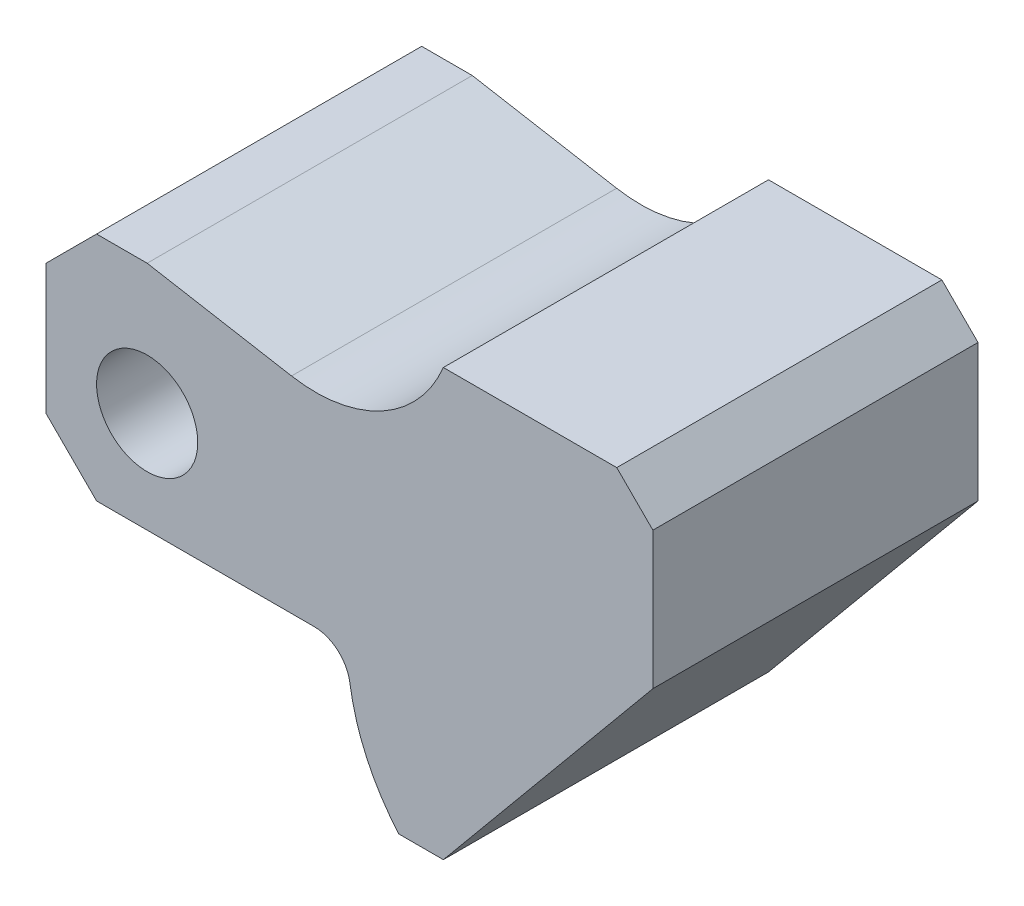
ISO-10303-21;
HEADER;
FILE_DESCRIPTION(('STEP AP214'),'2;1');
FILE_NAME('part.step','',(''),(''),'','','');
FILE_SCHEMA(('AUTOMOTIVE_DESIGN { 1 0 10303 214 1 1 1 1 }'));
ENDSEC;
DATA;
#1=APPLICATION_CONTEXT('core data for automotive mechanical design processes');
#2=APPLICATION_PROTOCOL_DEFINITION('international standard','automotive_design',2000,#1);
#3=PRODUCT_CONTEXT('',#1,'mechanical');
#4=PRODUCT('Part','Part','',(#3));
#5=PRODUCT_RELATED_PRODUCT_CATEGORY('part','',(#4));
#6=PRODUCT_DEFINITION_FORMATION('','',#4);
#7=PRODUCT_DEFINITION_CONTEXT('part definition',#1,'design');
#8=PRODUCT_DEFINITION('design','',#6,#7);
#9=PRODUCT_DEFINITION_SHAPE('','',#8);
#10=(LENGTH_UNIT() NAMED_UNIT(*) SI_UNIT(.MILLI.,.METRE.));
#11=(NAMED_UNIT(*) PLANE_ANGLE_UNIT() SI_UNIT($,.RADIAN.));
#12=(NAMED_UNIT(*) SI_UNIT($,.STERADIAN.) SOLID_ANGLE_UNIT());
#13=UNCERTAINTY_MEASURE_WITH_UNIT(LENGTH_MEASURE(1.E-05),#10,'distance_accuracy_value','');
#14=(GEOMETRIC_REPRESENTATION_CONTEXT(3) GLOBAL_UNCERTAINTY_ASSIGNED_CONTEXT((#13)) GLOBAL_UNIT_ASSIGNED_CONTEXT((#10,
#11,#12)) REPRESENTATION_CONTEXT('',''));
#15=CARTESIAN_POINT('',(0.,0.,0.));
#16=DIRECTION('',(0.,0.,1.));
#17=DIRECTION('',(1.,0.,0.));
#18=AXIS2_PLACEMENT_3D('',#15,#16,#17);
#19=CARTESIAN_POINT('',(70.7428571428571,0.,22.5));
#20=DIRECTION('',(0.,0.,1.));
#21=DIRECTION('',(1.,0.,0.));
#22=AXIS2_PLACEMENT_3D('',#19,#20,#21);
#23=PLANE('',#22);
#24=CARTESIAN_POINT('',(70.7428571428571,0.,22.5));
#25=DIRECTION('',(0.,0.,1.));
#26=DIRECTION('',(1.,0.,0.));
#27=AXIS2_PLACEMENT_3D('',#24,#25,#26);
#28=CIRCLE('',#27,29.);
#29=CARTESIAN_POINT('',(42.0581524426685,-4.26470588235294,22.5));
#30=VERTEX_POINT('',#29);
#31=CARTESIAN_POINT('',(48.8339548426505,-19.,22.5));
#32=VERTEX_POINT('',#31);
#33=EDGE_CURVE('E207',#30,#32,#28,.T.);
#34=ORIENTED_EDGE('',*,*,#33,.T.);
#35=DIRECTION('',(1.,0.,0.));
#36=VECTOR('',#35,1.);
#37=CARTESIAN_POINT('',(48.8339548426505,-19.,22.5));
#38=LINE('',#37,#36);
#39=CARTESIAN_POINT('',(55.,-19.,22.5));
#40=VERTEX_POINT('',#39);
#41=EDGE_CURVE('E125',#32,#40,#38,.T.);
#42=ORIENTED_EDGE('',*,*,#41,.T.);
#43=DIRECTION('',(0.638017864750323,0.770021560905562,0.));
#44=VECTOR('',#43,1.);
#45=CARTESIAN_POINT('',(55.,-19.,22.5));
#46=LINE('',#45,#44);
#47=CARTESIAN_POINT('',(84.,16.,22.5));
#48=VERTEX_POINT('',#47);
#49=EDGE_CURVE('E240',#40,#48,#46,.T.);
#50=ORIENTED_EDGE('',*,*,#49,.T.);
#51=DIRECTION('',(0.,1.,0.));
#52=VECTOR('',#51,1.);
#53=CARTESIAN_POINT('',(84.,16.,22.5));
#54=LINE('',#53,#52);
#55=CARTESIAN_POINT('',(84.,35.,22.5));
#56=VERTEX_POINT('',#55);
#57=EDGE_CURVE('E259',#48,#56,#54,.T.);
#58=ORIENTED_EDGE('',*,*,#57,.T.);
#59=DIRECTION('',(-0.707106781186546,0.707106781186549,0.));
#60=VECTOR('',#59,1.);
#61=CARTESIAN_POINT('',(84.,35.,22.5));
#62=LINE('',#61,#60);
#63=CARTESIAN_POINT('',(79.,40.,22.5));
#64=VERTEX_POINT('',#63);
#65=EDGE_CURVE('E256',#56,#64,#62,.T.);
#66=ORIENTED_EDGE('',*,*,#65,.T.);
#67=DIRECTION('',(-1.,0.,0.));
#68=VECTOR('',#67,1.);
#69=CARTESIAN_POINT('',(79.,40.,22.5));
#70=LINE('',#69,#68);
#71=CARTESIAN_POINT('',(55.,40.,22.5));
#72=VERTEX_POINT('',#71);
#73=EDGE_CURVE('E258',#64,#72,#70,.T.);
#74=ORIENTED_EDGE('',*,*,#73,.T.);
#75=CARTESIAN_POINT('',(37.3103485828417,47.3354399295799,22.5));
#76=DIRECTION('',(0.,0.,-1.));
#77=DIRECTION('',(-1.,0.,0.));
#78=AXIS2_PLACEMENT_3D('',#75,#76,#77);
#79=CIRCLE('',#78,19.1502596906947);
#80=CARTESIAN_POINT('',(33.9849408857041,28.4761157139866,22.5));
#81=VERTEX_POINT('',#80);
#82=EDGE_CURVE('E261',#72,#81,#79,.T.);
#83=ORIENTED_EDGE('',*,*,#82,.T.);
#84=DIRECTION('',(-0.984807753012208,0.173648177666931,0.));
#85=VECTOR('',#84,1.);
#86=CARTESIAN_POINT('',(33.9849408857041,28.4761157139866,22.5));
#87=LINE('',#86,#85);
#88=CARTESIAN_POINT('',(14.,32.,22.5));
#89=VERTEX_POINT('',#88);
#90=EDGE_CURVE('E267',#81,#89,#87,.T.);
#91=ORIENTED_EDGE('',*,*,#90,.T.);
#92=DIRECTION('',(-1.,0.,0.));
#93=VECTOR('',#92,1.);
#94=CARTESIAN_POINT('',(14.,32.,22.5));
#95=LINE('',#94,#93);
#96=CARTESIAN_POINT('',(7.,32.,22.5));
#97=VERTEX_POINT('',#96);
#98=EDGE_CURVE('E269',#89,#97,#95,.T.);
#99=ORIENTED_EDGE('',*,*,#98,.T.);
#100=DIRECTION('',(-0.707106781186548,-0.707106781186546,0.));
#101=VECTOR('',#100,1.);
#102=CARTESIAN_POINT('',(7.,32.,22.5));
#103=LINE('',#102,#101);
#104=CARTESIAN_POINT('',(0.,25.,22.5));
#105=VERTEX_POINT('',#104);
#106=EDGE_CURVE('E271',#97,#105,#103,.T.);
#107=ORIENTED_EDGE('',*,*,#106,.T.);
#108=DIRECTION('',(0.,-1.,0.));
#109=VECTOR('',#108,1.);
#110=CARTESIAN_POINT('',(0.,25.,22.5));
#111=LINE('',#110,#109);
#112=CARTESIAN_POINT('',(0.,7.,22.5));
#113=VERTEX_POINT('',#112);
#114=EDGE_CURVE('E162',#105,#113,#111,.T.);
#115=ORIENTED_EDGE('',*,*,#114,.T.);
#116=DIRECTION('',(0.707106781186547,-0.707106781186548,0.));
#117=VECTOR('',#116,1.);
#118=CARTESIAN_POINT('',(0.,7.,22.5));
#119=LINE('',#118,#117);
#120=CARTESIAN_POINT('',(6.99999999999998,0.,22.5));
#121=VERTEX_POINT('',#120);
#122=EDGE_CURVE('E156',#113,#121,#119,.T.);
#123=ORIENTED_EDGE('',*,*,#122,.T.);
#124=DIRECTION('',(1.,0.,0.));
#125=VECTOR('',#124,1.);
#126=CARTESIAN_POINT('',(6.99999999999998,0.,22.5));
#127=LINE('',#126,#125);
#128=CARTESIAN_POINT('',(37.1125137012567,0.,22.5));
#129=VERTEX_POINT('',#128);
#130=EDGE_CURVE('E160',#121,#129,#127,.T.);
#131=ORIENTED_EDGE('',*,*,#130,.T.);
#132=CARTESIAN_POINT('',(37.1125137012567,-5.,22.5));
#133=DIRECTION('',(0.,0.,-1.));
#134=DIRECTION('',(-1.,0.,0.));
#135=AXIS2_PLACEMENT_3D('',#132,#133,#134);
#136=CIRCLE('',#135,5.);
#137=EDGE_CURVE('E64',#129,#30,#136,.T.);
#138=ORIENTED_EDGE('',*,*,#137,.T.);
#139=EDGE_LOOP('',(#34,#42,#50,#58,#66,#74,#83,#91,#99,#107,#115,#123,#131,#138));
#140=FACE_BOUND('',#139,.T.);
#141=CARTESIAN_POINT('',(14.,14.,22.5));
#142=DIRECTION('',(0.,0.,1.));
#143=DIRECTION('',(1.,0.,0.));
#144=AXIS2_PLACEMENT_3D('',#141,#142,#143);
#145=CIRCLE('',#144,7.);
#146=CARTESIAN_POINT('',(21.,14.,22.5));
#147=VERTEX_POINT('',#146);
#148=EDGE_CURVE('E184',#147,#147,#145,.T.);
#149=ORIENTED_EDGE('',*,*,#148,.F.);
#150=EDGE_LOOP('',(#149));
#151=FACE_BOUND('',#150,.T.);
#152=ADVANCED_FACE('F47',(#140,#151),#23,.T.);
#153=CARTESIAN_POINT('',(70.7428571428571,0.,-22.5));
#154=DIRECTION('',(0.,0.,1.));
#155=DIRECTION('',(1.,0.,0.));
#156=AXIS2_PLACEMENT_3D('',#153,#154,#155);
#157=PLANE('',#156);
#158=CARTESIAN_POINT('',(70.7428571428571,0.,-22.5));
#159=DIRECTION('',(0.,0.,1.));
#160=DIRECTION('',(1.,0.,0.));
#161=AXIS2_PLACEMENT_3D('',#158,#159,#160);
#162=CIRCLE('',#161,29.);
#163=CARTESIAN_POINT('',(42.0581524426685,-4.26470588235294,-22.5));
#164=VERTEX_POINT('',#163);
#165=CARTESIAN_POINT('',(48.8339548426505,-19.,-22.5));
#166=VERTEX_POINT('',#165);
#167=EDGE_CURVE('E180',#164,#166,#162,.T.);
#168=ORIENTED_EDGE('',*,*,#167,.F.);
#169=CARTESIAN_POINT('',(37.1125137012567,-5.,-22.5));
#170=DIRECTION('',(0.,0.,-1.));
#171=DIRECTION('',(-1.,0.,0.));
#172=AXIS2_PLACEMENT_3D('',#169,#170,#171);
#173=CIRCLE('',#172,5.);
#174=CARTESIAN_POINT('',(37.1125137012567,0.,-22.5));
#175=VERTEX_POINT('',#174);
#176=EDGE_CURVE('E117',#175,#164,#173,.T.);
#177=ORIENTED_EDGE('',*,*,#176,.F.);
#178=DIRECTION('',(1.,0.,0.));
#179=VECTOR('',#178,1.);
#180=CARTESIAN_POINT('',(6.99999999999998,0.,-22.5));
#181=LINE('',#180,#179);
#182=CARTESIAN_POINT('',(6.99999999999998,0.,-22.5));
#183=VERTEX_POINT('',#182);
#184=EDGE_CURVE('E111',#183,#175,#181,.T.);
#185=ORIENTED_EDGE('',*,*,#184,.F.);
#186=DIRECTION('',(0.707106781186547,-0.707106781186548,0.));
#187=VECTOR('',#186,1.);
#188=CARTESIAN_POINT('',(0.,7.,-22.5));
#189=LINE('',#188,#187);
#190=CARTESIAN_POINT('',(0.,7.,-22.5));
#191=VERTEX_POINT('',#190);
#192=EDGE_CURVE('E170',#191,#183,#189,.T.);
#193=ORIENTED_EDGE('',*,*,#192,.F.);
#194=DIRECTION('',(0.,-1.,0.));
#195=VECTOR('',#194,1.);
#196=CARTESIAN_POINT('',(0.,25.,-22.5));
#197=LINE('',#196,#195);
#198=CARTESIAN_POINT('',(0.,25.,-22.5));
#199=VERTEX_POINT('',#198);
#200=EDGE_CURVE('E202',#199,#191,#197,.T.);
#201=ORIENTED_EDGE('',*,*,#200,.F.);
#202=DIRECTION('',(-0.707106781186548,-0.707106781186546,0.));
#203=VECTOR('',#202,1.);
#204=CARTESIAN_POINT('',(7.,32.,-22.5));
#205=LINE('',#204,#203);
#206=CARTESIAN_POINT('',(7.,32.,-22.5));
#207=VERTEX_POINT('',#206);
#208=EDGE_CURVE('E200',#207,#199,#205,.T.);
#209=ORIENTED_EDGE('',*,*,#208,.F.);
#210=DIRECTION('',(-1.,0.,0.));
#211=VECTOR('',#210,1.);
#212=CARTESIAN_POINT('',(14.,32.,-22.5));
#213=LINE('',#212,#211);
#214=CARTESIAN_POINT('',(14.,32.,-22.5));
#215=VERTEX_POINT('',#214);
#216=EDGE_CURVE('E198',#215,#207,#213,.T.);
#217=ORIENTED_EDGE('',*,*,#216,.F.);
#218=DIRECTION('',(-0.984807753012208,0.173648177666931,0.));
#219=VECTOR('',#218,1.);
#220=CARTESIAN_POINT('',(33.9849408857041,28.4761157139866,-22.5));
#221=LINE('',#220,#219);
#222=CARTESIAN_POINT('',(33.9849408857041,28.4761157139866,-22.5));
#223=VERTEX_POINT('',#222);
#224=EDGE_CURVE('E196',#223,#215,#221,.T.);
#225=ORIENTED_EDGE('',*,*,#224,.F.);
#226=CARTESIAN_POINT('',(37.3103485828417,47.3354399295799,-22.5));
#227=DIRECTION('',(0.,0.,-1.));
#228=DIRECTION('',(-1.,0.,0.));
#229=AXIS2_PLACEMENT_3D('',#226,#227,#228);
#230=CIRCLE('',#229,19.1502596906947);
#231=CARTESIAN_POINT('',(55.,40.,-22.5));
#232=VERTEX_POINT('',#231);
#233=EDGE_CURVE('E194',#232,#223,#230,.T.);
#234=ORIENTED_EDGE('',*,*,#233,.F.);
#235=DIRECTION('',(-1.,0.,0.));
#236=VECTOR('',#235,1.);
#237=CARTESIAN_POINT('',(79.,40.,-22.5));
#238=LINE('',#237,#236);
#239=CARTESIAN_POINT('',(79.,40.,-22.5));
#240=VERTEX_POINT('',#239);
#241=EDGE_CURVE('E192',#240,#232,#238,.T.);
#242=ORIENTED_EDGE('',*,*,#241,.F.);
#243=DIRECTION('',(-0.707106781186546,0.707106781186549,0.));
#244=VECTOR('',#243,1.);
#245=CARTESIAN_POINT('',(84.,35.,-22.5));
#246=LINE('',#245,#244);
#247=CARTESIAN_POINT('',(84.,35.,-22.5));
#248=VERTEX_POINT('',#247);
#249=EDGE_CURVE('E190',#248,#240,#246,.T.);
#250=ORIENTED_EDGE('',*,*,#249,.F.);
#251=DIRECTION('',(0.,1.,0.));
#252=VECTOR('',#251,1.);
#253=CARTESIAN_POINT('',(84.,16.,-22.5));
#254=LINE('',#253,#252);
#255=CARTESIAN_POINT('',(84.,16.,-22.5));
#256=VERTEX_POINT('',#255);
#257=EDGE_CURVE('E188',#256,#248,#254,.T.);
#258=ORIENTED_EDGE('',*,*,#257,.F.);
#259=DIRECTION('',(0.638017864750323,0.770021560905562,0.));
#260=VECTOR('',#259,1.);
#261=CARTESIAN_POINT('',(55.,-19.,-22.5));
#262=LINE('',#261,#260);
#263=CARTESIAN_POINT('',(55.,-19.,-22.5));
#264=VERTEX_POINT('',#263);
#265=EDGE_CURVE('E186',#264,#256,#262,.T.);
#266=ORIENTED_EDGE('',*,*,#265,.F.);
#267=DIRECTION('',(1.,0.,0.));
#268=VECTOR('',#267,1.);
#269=CARTESIAN_POINT('',(48.8339548426505,-19.,-22.5));
#270=LINE('',#269,#268);
#271=EDGE_CURVE('E183',#166,#264,#270,.T.);
#272=ORIENTED_EDGE('',*,*,#271,.F.);
#273=EDGE_LOOP('',(#168,#177,#185,#193,#201,#209,#217,#225,#234,#242,#250,#258,#266,#272));
#274=FACE_BOUND('',#273,.T.);
#275=CARTESIAN_POINT('',(14.,14.,-22.5));
#276=DIRECTION('',(0.,0.,1.));
#277=DIRECTION('',(1.,0.,0.));
#278=AXIS2_PLACEMENT_3D('',#275,#276,#277);
#279=CIRCLE('',#278,7.);
#280=CARTESIAN_POINT('',(21.,14.,-22.5));
#281=VERTEX_POINT('',#280);
#282=EDGE_CURVE('E512',#281,#281,#279,.T.);
#283=ORIENTED_EDGE('',*,*,#282,.T.);
#284=EDGE_LOOP('',(#283));
#285=FACE_BOUND('',#284,.T.);
#286=ADVANCED_FACE('F244',(#274,#285),#157,.F.);
#287=CARTESIAN_POINT('',(70.7428571428571,0.,22.5));
#288=DIRECTION('',(0.,0.,-1.));
#289=DIRECTION('',(-1.,0.,0.));
#290=AXIS2_PLACEMENT_3D('',#287,#288,#289);
#291=CYLINDRICAL_SURFACE('',#290,29.);
#292=ORIENTED_EDGE('',*,*,#167,.T.);
#293=DIRECTION('',(0.,0.,-1.));
#294=VECTOR('',#293,1.);
#295=CARTESIAN_POINT('',(48.8339548426505,-19.,22.5));
#296=LINE('',#295,#294);
#297=EDGE_CURVE('E11',#32,#166,#296,.T.);
#298=ORIENTED_EDGE('',*,*,#297,.F.);
#299=ORIENTED_EDGE('',*,*,#33,.F.);
#300=DIRECTION('',(0.,0.,-1.));
#301=VECTOR('',#300,1.);
#302=CARTESIAN_POINT('',(42.0581524426685,-4.26470588235294,22.5));
#303=LINE('',#302,#301);
#304=EDGE_CURVE('E176',#30,#164,#303,.T.);
#305=ORIENTED_EDGE('',*,*,#304,.T.);
#306=EDGE_LOOP('',(#292,#298,#299,#305));
#307=FACE_BOUND('',#306,.T.);
#308=ADVANCED_FACE('F49',(#307),#291,.T.);
#309=CARTESIAN_POINT('',(48.8339548426505,-19.,22.5));
#310=DIRECTION('',(0.,1.,0.));
#311=DIRECTION('',(-1.,0.,0.));
#312=AXIS2_PLACEMENT_3D('',#309,#310,#311);
#313=PLANE('',#312);
#314=ORIENTED_EDGE('',*,*,#271,.T.);
#315=DIRECTION('',(0.,0.,-1.));
#316=VECTOR('',#315,1.);
#317=CARTESIAN_POINT('',(55.,-19.,22.5));
#318=LINE('',#317,#316);
#319=EDGE_CURVE('E56',#40,#264,#318,.T.);
#320=ORIENTED_EDGE('',*,*,#319,.F.);
#321=ORIENTED_EDGE('',*,*,#41,.F.);
#322=ORIENTED_EDGE('',*,*,#297,.T.);
#323=EDGE_LOOP('',(#314,#320,#321,#322));
#324=FACE_BOUND('',#323,.T.);
#325=ADVANCED_FACE('F305',(#324),#313,.F.);
#326=CARTESIAN_POINT('',(55.,-19.,22.5));
#327=DIRECTION('',(-0.770021560905562,0.638017864750323,0.));
#328=DIRECTION('',(-0.638017864750323,-0.770021560905562,0.));
#329=AXIS2_PLACEMENT_3D('',#326,#327,#328);
#330=PLANE('',#329);
#331=ORIENTED_EDGE('',*,*,#265,.T.);
#332=DIRECTION('',(0.,0.,-1.));
#333=VECTOR('',#332,1.);
#334=CARTESIAN_POINT('',(84.,16.,22.5));
#335=LINE('',#334,#333);
#336=EDGE_CURVE('E232',#48,#256,#335,.T.);
#337=ORIENTED_EDGE('',*,*,#336,.F.);
#338=ORIENTED_EDGE('',*,*,#49,.F.);
#339=ORIENTED_EDGE('',*,*,#319,.T.);
#340=EDGE_LOOP('',(#331,#337,#338,#339));
#341=FACE_BOUND('',#340,.T.);
#342=ADVANCED_FACE('F238',(#341),#330,.F.);
#343=CARTESIAN_POINT('',(84.,16.,22.5));
#344=DIRECTION('',(-1.,0.,0.));
#345=DIRECTION('',(0.,-1.,0.));
#346=AXIS2_PLACEMENT_3D('',#343,#344,#345);
#347=PLANE('',#346);
#348=ORIENTED_EDGE('',*,*,#257,.T.);
#349=DIRECTION('',(0.,0.,-1.));
#350=VECTOR('',#349,1.);
#351=CARTESIAN_POINT('',(84.,35.,22.5));
#352=LINE('',#351,#350);
#353=EDGE_CURVE('E229',#56,#248,#352,.T.);
#354=ORIENTED_EDGE('',*,*,#353,.F.);
#355=ORIENTED_EDGE('',*,*,#57,.F.);
#356=ORIENTED_EDGE('',*,*,#336,.T.);
#357=EDGE_LOOP('',(#348,#354,#355,#356));
#358=FACE_BOUND('',#357,.T.);
#359=ADVANCED_FACE('F250',(#358),#347,.F.);
#360=CARTESIAN_POINT('',(84.,35.,22.5));
#361=DIRECTION('',(-0.707106781186549,-0.707106781186546,0.));
#362=DIRECTION('',(0.707106781186546,-0.707106781186549,0.));
#363=AXIS2_PLACEMENT_3D('',#360,#361,#362);
#364=PLANE('',#363);
#365=ORIENTED_EDGE('',*,*,#249,.T.);
#366=DIRECTION('',(0.,0.,-1.));
#367=VECTOR('',#366,1.);
#368=CARTESIAN_POINT('',(79.,40.,22.5));
#369=LINE('',#368,#367);
#370=EDGE_CURVE('E226',#64,#240,#369,.T.);
#371=ORIENTED_EDGE('',*,*,#370,.F.);
#372=ORIENTED_EDGE('',*,*,#65,.F.);
#373=ORIENTED_EDGE('',*,*,#353,.T.);
#374=EDGE_LOOP('',(#365,#371,#372,#373));
#375=FACE_BOUND('',#374,.T.);
#376=ADVANCED_FACE('F254',(#375),#364,.F.);
#377=CARTESIAN_POINT('',(79.,40.,22.5));
#378=DIRECTION('',(0.,-1.,0.));
#379=DIRECTION('',(1.,0.,0.));
#380=AXIS2_PLACEMENT_3D('',#377,#378,#379);
#381=PLANE('',#380);
#382=ORIENTED_EDGE('',*,*,#241,.T.);
#383=DIRECTION('',(0.,0.,-1.));
#384=VECTOR('',#383,1.);
#385=CARTESIAN_POINT('',(55.,40.,22.5));
#386=LINE('',#385,#384);
#387=EDGE_CURVE('E223',#72,#232,#386,.T.);
#388=ORIENTED_EDGE('',*,*,#387,.F.);
#389=ORIENTED_EDGE('',*,*,#73,.F.);
#390=ORIENTED_EDGE('',*,*,#370,.T.);
#391=EDGE_LOOP('',(#382,#388,#389,#390));
#392=FACE_BOUND('',#391,.T.);
#393=ADVANCED_FACE('F318',(#392),#381,.F.);
#394=CARTESIAN_POINT('',(37.3103485828417,47.3354399295799,22.5));
#395=DIRECTION('',(0.,0.,-1.));
#396=DIRECTION('',(-1.,0.,0.));
#397=AXIS2_PLACEMENT_3D('',#394,#395,#396);
#398=CYLINDRICAL_SURFACE('',#397,19.1502596906947);
#399=ORIENTED_EDGE('',*,*,#233,.T.);
#400=DIRECTION('',(0.,0.,-1.));
#401=VECTOR('',#400,1.);
#402=CARTESIAN_POINT('',(33.9849408857041,28.4761157139866,22.5));
#403=LINE('',#402,#401);
#404=EDGE_CURVE('E220',#81,#223,#403,.T.);
#405=ORIENTED_EDGE('',*,*,#404,.F.);
#406=ORIENTED_EDGE('',*,*,#82,.F.);
#407=ORIENTED_EDGE('',*,*,#387,.T.);
#408=EDGE_LOOP('',(#399,#405,#406,#407));
#409=FACE_BOUND('',#408,.T.);
#410=ADVANCED_FACE('F321',(#409),#398,.F.);
#411=CARTESIAN_POINT('',(33.9849408857041,28.4761157139866,22.5));
#412=DIRECTION('',(-0.173648177666931,-0.984807753012208,0.));
#413=DIRECTION('',(0.984807753012208,-0.173648177666931,0.));
#414=AXIS2_PLACEMENT_3D('',#411,#412,#413);
#415=PLANE('',#414);
#416=ORIENTED_EDGE('',*,*,#224,.T.);
#417=DIRECTION('',(0.,0.,-1.));
#418=VECTOR('',#417,1.);
#419=CARTESIAN_POINT('',(14.,32.,22.5));
#420=LINE('',#419,#418);
#421=EDGE_CURVE('E217',#89,#215,#420,.T.);
#422=ORIENTED_EDGE('',*,*,#421,.F.);
#423=ORIENTED_EDGE('',*,*,#90,.F.);
#424=ORIENTED_EDGE('',*,*,#404,.T.);
#425=EDGE_LOOP('',(#416,#422,#423,#424));
#426=FACE_BOUND('',#425,.T.);
#427=ADVANCED_FACE('F325',(#426),#415,.F.);
#428=CARTESIAN_POINT('',(14.,32.,22.5));
#429=DIRECTION('',(0.,-1.,0.));
#430=DIRECTION('',(0.,0.,-1.));
#431=AXIS2_PLACEMENT_3D('',#428,#429,#430);
#432=PLANE('',#431);
#433=ORIENTED_EDGE('',*,*,#216,.T.);
#434=DIRECTION('',(0.,0.,-1.));
#435=VECTOR('',#434,1.);
#436=CARTESIAN_POINT('',(7.,32.,22.5));
#437=LINE('',#436,#435);
#438=EDGE_CURVE('E214',#97,#207,#437,.T.);
#439=ORIENTED_EDGE('',*,*,#438,.F.);
#440=ORIENTED_EDGE('',*,*,#98,.F.);
#441=ORIENTED_EDGE('',*,*,#421,.T.);
#442=EDGE_LOOP('',(#433,#439,#440,#441));
#443=FACE_BOUND('',#442,.T.);
#444=ADVANCED_FACE('F329',(#443),#432,.F.);
#445=CARTESIAN_POINT('',(7.,32.,22.5));
#446=DIRECTION('',(0.707106781186546,-0.707106781186548,0.));
#447=DIRECTION('',(0.707106781186549,0.707106781186547,0.));
#448=AXIS2_PLACEMENT_3D('',#445,#446,#447);
#449=PLANE('',#448);
#450=ORIENTED_EDGE('',*,*,#208,.T.);
#451=DIRECTION('',(0.,0.,-1.));
#452=VECTOR('',#451,1.);
#453=CARTESIAN_POINT('',(0.,25.,22.5));
#454=LINE('',#453,#452);
#455=EDGE_CURVE('E211',#105,#199,#454,.T.);
#456=ORIENTED_EDGE('',*,*,#455,.F.);
#457=ORIENTED_EDGE('',*,*,#106,.F.);
#458=ORIENTED_EDGE('',*,*,#438,.T.);
#459=EDGE_LOOP('',(#450,#456,#457,#458));
#460=FACE_BOUND('',#459,.T.);
#461=ADVANCED_FACE('F277',(#460),#449,.F.);
#462=CARTESIAN_POINT('',(0.,25.,22.5));
#463=DIRECTION('',(1.,0.,0.));
#464=DIRECTION('',(0.,1.,0.));
#465=AXIS2_PLACEMENT_3D('',#462,#463,#464);
#466=PLANE('',#465);
#467=ORIENTED_EDGE('',*,*,#200,.T.);
#468=DIRECTION('',(0.,0.,-1.));
#469=VECTOR('',#468,1.);
#470=CARTESIAN_POINT('',(0.,7.,22.5));
#471=LINE('',#470,#469);
#472=EDGE_CURVE('E171',#113,#191,#471,.T.);
#473=ORIENTED_EDGE('',*,*,#472,.F.);
#474=ORIENTED_EDGE('',*,*,#114,.F.);
#475=ORIENTED_EDGE('',*,*,#455,.T.);
#476=EDGE_LOOP('',(#467,#473,#474,#475));
#477=FACE_BOUND('',#476,.T.);
#478=ADVANCED_FACE('F281',(#477),#466,.F.);
#479=CARTESIAN_POINT('',(0.,7.,22.5));
#480=DIRECTION('',(0.707106781186548,0.707106781186547,0.));
#481=DIRECTION('',(-0.707106781186547,0.707106781186548,0.));
#482=AXIS2_PLACEMENT_3D('',#479,#480,#481);
#483=PLANE('',#482);
#484=ORIENTED_EDGE('',*,*,#192,.T.);
#485=DIRECTION('',(0.,0.,-1.));
#486=VECTOR('',#485,1.);
#487=CARTESIAN_POINT('',(6.99999999999998,0.,22.5));
#488=LINE('',#487,#486);
#489=EDGE_CURVE('E167',#121,#183,#488,.T.);
#490=ORIENTED_EDGE('',*,*,#489,.F.);
#491=ORIENTED_EDGE('',*,*,#122,.F.);
#492=ORIENTED_EDGE('',*,*,#472,.T.);
#493=EDGE_LOOP('',(#484,#490,#491,#492));
#494=FACE_BOUND('',#493,.T.);
#495=ADVANCED_FACE('F168',(#494),#483,.F.);
#496=CARTESIAN_POINT('',(6.99999999999998,0.,22.5));
#497=DIRECTION('',(0.,1.,0.));
#498=DIRECTION('',(-1.,0.,0.));
#499=AXIS2_PLACEMENT_3D('',#496,#497,#498);
#500=PLANE('',#499);
#501=ORIENTED_EDGE('',*,*,#184,.T.);
#502=DIRECTION('',(0.,0.,-1.));
#503=VECTOR('',#502,1.);
#504=CARTESIAN_POINT('',(37.1125137012567,0.,22.5));
#505=LINE('',#504,#503);
#506=EDGE_CURVE('E172',#129,#175,#505,.T.);
#507=ORIENTED_EDGE('',*,*,#506,.F.);
#508=ORIENTED_EDGE('',*,*,#130,.F.);
#509=ORIENTED_EDGE('',*,*,#489,.T.);
#510=EDGE_LOOP('',(#501,#507,#508,#509));
#511=FACE_BOUND('',#510,.T.);
#512=ADVANCED_FACE('F174',(#511),#500,.F.);
#513=CARTESIAN_POINT('',(37.1125137012567,-5.,22.5));
#514=DIRECTION('',(0.,0.,-1.));
#515=DIRECTION('',(-1.,0.,0.));
#516=AXIS2_PLACEMENT_3D('',#513,#514,#515);
#517=CYLINDRICAL_SURFACE('',#516,5.);
#518=ORIENTED_EDGE('',*,*,#176,.T.);
#519=ORIENTED_EDGE('',*,*,#304,.F.);
#520=ORIENTED_EDGE('',*,*,#137,.F.);
#521=ORIENTED_EDGE('',*,*,#506,.T.);
#522=EDGE_LOOP('',(#518,#519,#520,#521));
#523=FACE_BOUND('',#522,.T.);
#524=ADVANCED_FACE('F285',(#523),#517,.F.);
#525=CARTESIAN_POINT('',(14.,14.,22.5));
#526=DIRECTION('',(0.,0.,-1.));
#527=DIRECTION('',(-1.,0.,0.));
#528=AXIS2_PLACEMENT_3D('',#525,#526,#527);
#529=CYLINDRICAL_SURFACE('',#528,7.);
#530=ORIENTED_EDGE('',*,*,#148,.T.);
#531=EDGE_LOOP('',(#530));
#532=FACE_BOUND('',#531,.T.);
#533=ORIENTED_EDGE('',*,*,#282,.F.);
#534=EDGE_LOOP('',(#533));
#535=FACE_BOUND('',#534,.T.);
#536=ADVANCED_FACE('F287',(#532,#535),#529,.F.);
#537=CLOSED_SHELL('',(#152,#286,#308,#325,#342,#359,#376,#393,#410,#427,#444,#461,#478,#495,
#512,#524,#536));
#538=MANIFOLD_SOLID_BREP('B2',#537);
#539=ADVANCED_BREP_SHAPE_REPRESENTATION('',(#18,#538),#14);
#540=SHAPE_DEFINITION_REPRESENTATION(#9,#539);
ENDSEC;
END-ISO-10303-21;
